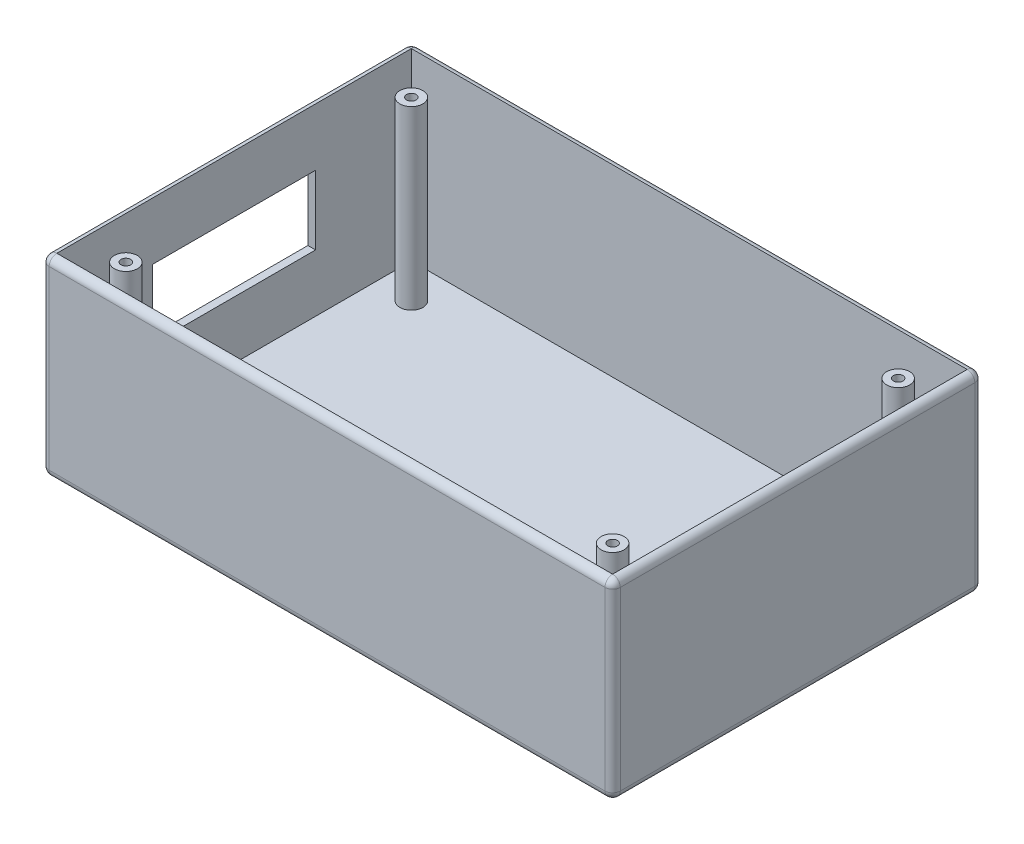
ISO-10303-21;
HEADER;
FILE_DESCRIPTION(('STEP AP214'),'2;1');
FILE_NAME('part.step','',(''),(''),'','','');
FILE_SCHEMA(('AUTOMOTIVE_DESIGN { 1 0 10303 214 1 1 1 1 }'));
ENDSEC;
DATA;
#1=APPLICATION_CONTEXT('core data for automotive mechanical design processes');
#2=APPLICATION_PROTOCOL_DEFINITION('international standard','automotive_design',2000,#1);
#3=PRODUCT_CONTEXT('',#1,'mechanical');
#4=PRODUCT('Part','Part','',(#3));
#5=PRODUCT_RELATED_PRODUCT_CATEGORY('part','',(#4));
#6=PRODUCT_DEFINITION_FORMATION('','',#4);
#7=PRODUCT_DEFINITION_CONTEXT('part definition',#1,'design');
#8=PRODUCT_DEFINITION('design','',#6,#7);
#9=PRODUCT_DEFINITION_SHAPE('','',#8);
#10=(LENGTH_UNIT() NAMED_UNIT(*) SI_UNIT(.MILLI.,.METRE.));
#11=(NAMED_UNIT(*) PLANE_ANGLE_UNIT() SI_UNIT($,.RADIAN.));
#12=(NAMED_UNIT(*) SI_UNIT($,.STERADIAN.) SOLID_ANGLE_UNIT());
#13=UNCERTAINTY_MEASURE_WITH_UNIT(LENGTH_MEASURE(1.E-05),#10,'distance_accuracy_value','');
#14=(GEOMETRIC_REPRESENTATION_CONTEXT(3) GLOBAL_UNCERTAINTY_ASSIGNED_CONTEXT((#13)) GLOBAL_UNIT_ASSIGNED_CONTEXT((#10,
#11,#12)) REPRESENTATION_CONTEXT('',''));
#15=CARTESIAN_POINT('',(0.,0.,0.));
#16=DIRECTION('',(0.,0.,1.));
#17=DIRECTION('',(1.,0.,0.));
#18=AXIS2_PLACEMENT_3D('',#15,#16,#17);
#19=CARTESIAN_POINT('',(74.5,50.,-48.25));
#20=DIRECTION('',(-1.,0.,0.));
#21=DIRECTION('',(0.,0.,1.));
#22=AXIS2_PLACEMENT_3D('',#19,#20,#21);
#23=PLANE('',#22);
#24=DIRECTION('',(0.,-1.,0.));
#25=VECTOR('',#24,1.);
#26=CARTESIAN_POINT('',(74.5,50.,-46.25));
#27=LINE('',#26,#25);
#28=CARTESIAN_POINT('',(74.5,2.,-46.25));
#29=VERTEX_POINT('',#28);
#30=CARTESIAN_POINT('',(74.5,48.,-46.25));
#31=VERTEX_POINT('',#30);
#32=EDGE_CURVE('E266',#29,#31,#27,.F.);
#33=ORIENTED_EDGE('',*,*,#32,.T.);
#34=DIRECTION('',(0.,0.,-1.));
#35=VECTOR('',#34,1.);
#36=CARTESIAN_POINT('',(74.5,48.,48.25));
#37=LINE('',#36,#35);
#38=CARTESIAN_POINT('',(74.5,48.,46.25));
#39=VERTEX_POINT('',#38);
#40=EDGE_CURVE('E268',#31,#39,#37,.F.);
#41=ORIENTED_EDGE('',*,*,#40,.T.);
#42=DIRECTION('',(0.,-1.,0.));
#43=VECTOR('',#42,1.);
#44=CARTESIAN_POINT('',(74.5,50.,46.25));
#45=LINE('',#44,#43);
#46=CARTESIAN_POINT('',(74.5,2.,46.25));
#47=VERTEX_POINT('',#46);
#48=EDGE_CURVE('E262',#39,#47,#45,.T.);
#49=ORIENTED_EDGE('',*,*,#48,.T.);
#50=DIRECTION('',(0.,0.,-1.));
#51=VECTOR('',#50,1.);
#52=CARTESIAN_POINT('',(74.5,2.,-48.25));
#53=LINE('',#52,#51);
#54=EDGE_CURVE('E264',#47,#29,#53,.T.);
#55=ORIENTED_EDGE('',*,*,#54,.T.);
#56=EDGE_LOOP('',(#33,#41,#49,#55));
#57=FACE_BOUND('',#56,.T.);
#58=ADVANCED_FACE('F34',(#57),#23,.F.);
#59=CARTESIAN_POINT('',(-74.5,50.,-48.25));
#60=DIRECTION('',(0.,0.,1.));
#61=DIRECTION('',(1.,0.,0.));
#62=AXIS2_PLACEMENT_3D('',#59,#60,#61);
#63=PLANE('',#62);
#64=DIRECTION('',(-1.,0.,0.));
#65=VECTOR('',#64,1.);
#66=CARTESIAN_POINT('',(74.5,48.,-48.25));
#67=LINE('',#66,#65);
#68=CARTESIAN_POINT('',(-72.5,48.,-48.25));
#69=VERTEX_POINT('',#68);
#70=CARTESIAN_POINT('',(72.5,48.,-48.25));
#71=VERTEX_POINT('',#70);
#72=EDGE_CURVE('E273',#69,#71,#67,.F.);
#73=ORIENTED_EDGE('',*,*,#72,.T.);
#74=DIRECTION('',(0.,-1.,0.));
#75=VECTOR('',#74,1.);
#76=CARTESIAN_POINT('',(72.5,50.,-48.25));
#77=LINE('',#76,#75);
#78=CARTESIAN_POINT('',(72.5,2.,-48.25));
#79=VERTEX_POINT('',#78);
#80=EDGE_CURVE('E277',#71,#79,#77,.T.);
#81=ORIENTED_EDGE('',*,*,#80,.T.);
#82=DIRECTION('',(-1.,0.,0.));
#83=VECTOR('',#82,1.);
#84=CARTESIAN_POINT('',(-74.5,2.,-48.25));
#85=LINE('',#84,#83);
#86=CARTESIAN_POINT('',(-72.5,2.,-48.25));
#87=VERTEX_POINT('',#86);
#88=EDGE_CURVE('E275',#79,#87,#85,.T.);
#89=ORIENTED_EDGE('',*,*,#88,.T.);
#90=DIRECTION('',(0.,-1.,0.));
#91=VECTOR('',#90,1.);
#92=CARTESIAN_POINT('',(-72.5,50.,-48.25));
#93=LINE('',#92,#91);
#94=EDGE_CURVE('E271',#87,#69,#93,.F.);
#95=ORIENTED_EDGE('',*,*,#94,.T.);
#96=EDGE_LOOP('',(#73,#81,#89,#95));
#97=FACE_BOUND('',#96,.T.);
#98=ADVANCED_FACE('F398',(#97),#63,.F.);
#99=CARTESIAN_POINT('',(-74.5,50.,-48.25));
#100=DIRECTION('',(1.,0.,0.));
#101=DIRECTION('',(0.,0.,-1.));
#102=AXIS2_PLACEMENT_3D('',#99,#100,#101);
#103=PLANE('',#102);
#104=DIRECTION('',(0.,0.,1.));
#105=VECTOR('',#104,1.);
#106=CARTESIAN_POINT('',(-74.5,2.,-48.25));
#107=LINE('',#106,#105);
#108=CARTESIAN_POINT('',(-74.5,2.,-46.25));
#109=VERTEX_POINT('',#108);
#110=CARTESIAN_POINT('',(-74.5,2.,46.25));
#111=VERTEX_POINT('',#110);
#112=EDGE_CURVE('E58',#109,#111,#107,.T.);
#113=ORIENTED_EDGE('',*,*,#112,.T.);
#114=DIRECTION('',(0.,-1.,0.));
#115=VECTOR('',#114,1.);
#116=CARTESIAN_POINT('',(-74.5,50.,46.25));
#117=LINE('',#116,#115);
#118=CARTESIAN_POINT('',(-74.5,48.,46.25));
#119=VERTEX_POINT('',#118);
#120=EDGE_CURVE('E11',#111,#119,#117,.F.);
#121=ORIENTED_EDGE('',*,*,#120,.T.);
#122=DIRECTION('',(0.,0.,1.));
#123=VECTOR('',#122,1.);
#124=CARTESIAN_POINT('',(-74.5,48.,-48.25));
#125=LINE('',#124,#123);
#126=CARTESIAN_POINT('',(-74.5,48.,-46.25));
#127=VERTEX_POINT('',#126);
#128=EDGE_CURVE('E43',#119,#127,#125,.F.);
#129=ORIENTED_EDGE('',*,*,#128,.T.);
#130=DIRECTION('',(0.,-1.,0.));
#131=VECTOR('',#130,1.);
#132=CARTESIAN_POINT('',(-74.5,50.,-46.25));
#133=LINE('',#132,#131);
#134=EDGE_CURVE('E298',#127,#109,#133,.T.);
#135=ORIENTED_EDGE('',*,*,#134,.T.);
#136=EDGE_LOOP('',(#113,#121,#129,#135));
#137=FACE_BOUND('',#136,.T.);
#138=DIRECTION('',(0.,0.,1.));
#139=VECTOR('',#138,1.);
#140=CARTESIAN_POINT('',(-74.5,35.,-48.25));
#141=LINE('',#140,#139);
#142=CARTESIAN_POINT('',(-74.5,35.,-21.25));
#143=VERTEX_POINT('',#142);
#144=CARTESIAN_POINT('',(-74.5,35.,21.25));
#145=VERTEX_POINT('',#144);
#146=EDGE_CURVE('E201',#143,#145,#141,.T.);
#147=ORIENTED_EDGE('',*,*,#146,.T.);
#148=DIRECTION('',(0.,-1.,0.));
#149=VECTOR('',#148,1.);
#150=CARTESIAN_POINT('',(-74.5,50.,21.25));
#151=LINE('',#150,#149);
#152=CARTESIAN_POINT('',(-74.5,17.,21.25));
#153=VERTEX_POINT('',#152);
#154=EDGE_CURVE('E204',#145,#153,#151,.T.);
#155=ORIENTED_EDGE('',*,*,#154,.T.);
#156=DIRECTION('',(0.,0.,-1.));
#157=VECTOR('',#156,1.);
#158=CARTESIAN_POINT('',(-74.5,17.,-48.25));
#159=LINE('',#158,#157);
#160=CARTESIAN_POINT('',(-74.5,17.,-21.25));
#161=VERTEX_POINT('',#160);
#162=EDGE_CURVE('E196',#153,#161,#159,.T.);
#163=ORIENTED_EDGE('',*,*,#162,.T.);
#164=DIRECTION('',(0.,1.,0.));
#165=VECTOR('',#164,1.);
#166=CARTESIAN_POINT('',(-74.5,50.,-21.25));
#167=LINE('',#166,#165);
#168=EDGE_CURVE('E171',#161,#143,#167,.T.);
#169=ORIENTED_EDGE('',*,*,#168,.T.);
#170=EDGE_LOOP('',(#147,#155,#163,#169));
#171=FACE_BOUND('',#170,.T.);
#172=ADVANCED_FACE('F395',(#137,#171),#103,.F.);
#173=CARTESIAN_POINT('',(-74.5,50.,48.25));
#174=DIRECTION('',(0.,0.,-1.));
#175=DIRECTION('',(-1.,0.,0.));
#176=AXIS2_PLACEMENT_3D('',#173,#174,#175);
#177=PLANE('',#176);
#178=DIRECTION('',(1.,0.,0.));
#179=VECTOR('',#178,1.);
#180=CARTESIAN_POINT('',(-74.5,48.,48.25));
#181=LINE('',#180,#179);
#182=CARTESIAN_POINT('',(72.5,48.,48.25));
#183=VERTEX_POINT('',#182);
#184=CARTESIAN_POINT('',(-72.5,48.,48.25));
#185=VERTEX_POINT('',#184);
#186=EDGE_CURVE('E293',#183,#185,#181,.F.);
#187=ORIENTED_EDGE('',*,*,#186,.T.);
#188=DIRECTION('',(0.,-1.,0.));
#189=VECTOR('',#188,1.);
#190=CARTESIAN_POINT('',(-72.5,50.,48.25));
#191=LINE('',#190,#189);
#192=CARTESIAN_POINT('',(-72.5,2.,48.25));
#193=VERTEX_POINT('',#192);
#194=EDGE_CURVE('E295',#185,#193,#191,.T.);
#195=ORIENTED_EDGE('',*,*,#194,.T.);
#196=DIRECTION('',(1.,0.,0.));
#197=VECTOR('',#196,1.);
#198=CARTESIAN_POINT('',(-74.5,2.,48.25));
#199=LINE('',#198,#197);
#200=CARTESIAN_POINT('',(72.5,2.,48.25));
#201=VERTEX_POINT('',#200);
#202=EDGE_CURVE('E289',#193,#201,#199,.T.);
#203=ORIENTED_EDGE('',*,*,#202,.T.);
#204=DIRECTION('',(0.,-1.,0.));
#205=VECTOR('',#204,1.);
#206=CARTESIAN_POINT('',(72.5,50.,48.25));
#207=LINE('',#206,#205);
#208=EDGE_CURVE('E291',#201,#183,#207,.F.);
#209=ORIENTED_EDGE('',*,*,#208,.T.);
#210=EDGE_LOOP('',(#187,#195,#203,#209));
#211=FACE_BOUND('',#210,.T.);
#212=ADVANCED_FACE('F397',(#211),#177,.F.);
#213=CARTESIAN_POINT('',(0.,0.,0.));
#214=DIRECTION('',(0.,1.,0.));
#215=DIRECTION('',(0.,0.,1.));
#216=AXIS2_PLACEMENT_3D('',#213,#214,#215);
#217=PLANE('',#216);
#218=DIRECTION('',(-1.,0.,0.));
#219=VECTOR('',#218,1.);
#220=CARTESIAN_POINT('',(0.,0.,-46.25));
#221=LINE('',#220,#219);
#222=CARTESIAN_POINT('',(-72.5,0.,-46.25));
#223=VERTEX_POINT('',#222);
#224=CARTESIAN_POINT('',(72.5,0.,-46.25));
#225=VERTEX_POINT('',#224);
#226=EDGE_CURVE('E282',#223,#225,#221,.F.);
#227=ORIENTED_EDGE('',*,*,#226,.T.);
#228=DIRECTION('',(0.,0.,-1.));
#229=VECTOR('',#228,1.);
#230=CARTESIAN_POINT('',(72.5,0.,0.));
#231=LINE('',#230,#229);
#232=CARTESIAN_POINT('',(72.5,0.,46.25));
#233=VERTEX_POINT('',#232);
#234=EDGE_CURVE('E286',#225,#233,#231,.F.);
#235=ORIENTED_EDGE('',*,*,#234,.T.);
#236=DIRECTION('',(1.,0.,0.));
#237=VECTOR('',#236,1.);
#238=CARTESIAN_POINT('',(0.,0.,46.25));
#239=LINE('',#238,#237);
#240=CARTESIAN_POINT('',(-72.5,0.,46.25));
#241=VERTEX_POINT('',#240);
#242=EDGE_CURVE('E284',#233,#241,#239,.F.);
#243=ORIENTED_EDGE('',*,*,#242,.T.);
#244=DIRECTION('',(0.,0.,1.));
#245=VECTOR('',#244,1.);
#246=CARTESIAN_POINT('',(-72.5,0.,0.));
#247=LINE('',#246,#245);
#248=EDGE_CURVE('E280',#241,#223,#247,.F.);
#249=ORIENTED_EDGE('',*,*,#248,.T.);
#250=EDGE_LOOP('',(#227,#235,#243,#249));
#251=FACE_BOUND('',#250,.T.);
#252=ADVANCED_FACE('F404',(#251),#217,.F.);
#253=CARTESIAN_POINT('',(72.5,50.,-48.25));
#254=DIRECTION('',(-1.,0.,0.));
#255=DIRECTION('',(0.,0.,1.));
#256=AXIS2_PLACEMENT_3D('',#253,#254,#255);
#257=PLANE('',#256);
#258=DIRECTION('',(0.,0.,-1.));
#259=VECTOR('',#258,1.);
#260=CARTESIAN_POINT('',(72.5,2.,-48.25));
#261=LINE('',#260,#259);
#262=CARTESIAN_POINT('',(72.5,2.,46.25));
#263=VERTEX_POINT('',#262);
#264=CARTESIAN_POINT('',(72.5,2.,-46.25));
#265=VERTEX_POINT('',#264);
#266=EDGE_CURVE('E223',#263,#265,#261,.T.);
#267=ORIENTED_EDGE('',*,*,#266,.F.);
#268=DIRECTION('',(0.,-1.,0.));
#269=VECTOR('',#268,1.);
#270=CARTESIAN_POINT('',(72.5,50.,46.25));
#271=LINE('',#270,#269);
#272=CARTESIAN_POINT('',(72.5,50.,46.25));
#273=VERTEX_POINT('',#272);
#274=EDGE_CURVE('E234',#273,#263,#271,.T.);
#275=ORIENTED_EDGE('',*,*,#274,.F.);
#276=DIRECTION('',(0.,0.,-1.));
#277=VECTOR('',#276,1.);
#278=CARTESIAN_POINT('',(72.5,50.,-48.25));
#279=LINE('',#278,#277);
#280=CARTESIAN_POINT('',(72.5,50.,-46.25));
#281=VERTEX_POINT('',#280);
#282=EDGE_CURVE('E248',#273,#281,#279,.T.);
#283=ORIENTED_EDGE('',*,*,#282,.T.);
#284=DIRECTION('',(0.,-1.,0.));
#285=VECTOR('',#284,1.);
#286=CARTESIAN_POINT('',(72.5,50.,-46.25));
#287=LINE('',#286,#285);
#288=EDGE_CURVE('E229',#281,#265,#287,.T.);
#289=ORIENTED_EDGE('',*,*,#288,.T.);
#290=EDGE_LOOP('',(#267,#275,#283,#289));
#291=FACE_BOUND('',#290,.T.);
#292=ADVANCED_FACE('F532',(#291),#257,.T.);
#293=CARTESIAN_POINT('',(-74.5,50.,-46.25));
#294=DIRECTION('',(0.,0.,1.));
#295=DIRECTION('',(1.,0.,0.));
#296=AXIS2_PLACEMENT_3D('',#293,#294,#295);
#297=PLANE('',#296);
#298=DIRECTION('',(-1.,0.,0.));
#299=VECTOR('',#298,1.);
#300=CARTESIAN_POINT('',(-74.5,2.,-46.25));
#301=LINE('',#300,#299);
#302=CARTESIAN_POINT('',(-72.5,2.,-46.25));
#303=VERTEX_POINT('',#302);
#304=EDGE_CURVE('E228',#265,#303,#301,.T.);
#305=ORIENTED_EDGE('',*,*,#304,.F.);
#306=ORIENTED_EDGE('',*,*,#288,.F.);
#307=DIRECTION('',(-1.,0.,0.));
#308=VECTOR('',#307,1.);
#309=CARTESIAN_POINT('',(-74.5,50.,-46.25));
#310=LINE('',#309,#308);
#311=CARTESIAN_POINT('',(-72.5,50.,-46.25));
#312=VERTEX_POINT('',#311);
#313=EDGE_CURVE('E251',#281,#312,#310,.T.);
#314=ORIENTED_EDGE('',*,*,#313,.T.);
#315=DIRECTION('',(0.,-1.,0.));
#316=VECTOR('',#315,1.);
#317=CARTESIAN_POINT('',(-72.5,50.,-46.25));
#318=LINE('',#317,#316);
#319=EDGE_CURVE('E233',#312,#303,#318,.T.);
#320=ORIENTED_EDGE('',*,*,#319,.T.);
#321=EDGE_LOOP('',(#305,#306,#314,#320));
#322=FACE_BOUND('',#321,.T.);
#323=ADVANCED_FACE('F540',(#322),#297,.T.);
#324=CARTESIAN_POINT('',(-72.5,50.,-48.25));
#325=DIRECTION('',(1.,0.,0.));
#326=DIRECTION('',(0.,0.,-1.));
#327=AXIS2_PLACEMENT_3D('',#324,#325,#326);
#328=PLANE('',#327);
#329=DIRECTION('',(0.,-1.,0.));
#330=VECTOR('',#329,1.);
#331=CARTESIAN_POINT('',(-72.5,35.,21.25));
#332=LINE('',#331,#330);
#333=CARTESIAN_POINT('',(-72.5,35.,21.25));
#334=VERTEX_POINT('',#333);
#335=CARTESIAN_POINT('',(-72.5,17.,21.25));
#336=VERTEX_POINT('',#335);
#337=EDGE_CURVE('E184',#334,#336,#332,.T.);
#338=ORIENTED_EDGE('',*,*,#337,.F.);
#339=DIRECTION('',(0.,0.,1.));
#340=VECTOR('',#339,1.);
#341=CARTESIAN_POINT('',(-72.5,35.,21.25));
#342=LINE('',#341,#340);
#343=CARTESIAN_POINT('',(-72.5,35.,-21.25));
#344=VERTEX_POINT('',#343);
#345=EDGE_CURVE('E189',#344,#334,#342,.T.);
#346=ORIENTED_EDGE('',*,*,#345,.F.);
#347=DIRECTION('',(0.,1.,0.));
#348=VECTOR('',#347,1.);
#349=CARTESIAN_POINT('',(-72.5,35.,-21.25));
#350=LINE('',#349,#348);
#351=CARTESIAN_POINT('',(-72.5,17.,-21.25));
#352=VERTEX_POINT('',#351);
#353=EDGE_CURVE('E168',#352,#344,#350,.T.);
#354=ORIENTED_EDGE('',*,*,#353,.F.);
#355=DIRECTION('',(0.,0.,-1.));
#356=VECTOR('',#355,1.);
#357=CARTESIAN_POINT('',(-72.5,17.,21.25));
#358=LINE('',#357,#356);
#359=EDGE_CURVE('E179',#336,#352,#358,.T.);
#360=ORIENTED_EDGE('',*,*,#359,.F.);
#361=EDGE_LOOP('',(#338,#346,#354,#360));
#362=FACE_BOUND('',#361,.T.);
#363=DIRECTION('',(0.,0.,1.));
#364=VECTOR('',#363,1.);
#365=CARTESIAN_POINT('',(-72.5,2.,-48.25));
#366=LINE('',#365,#364);
#367=CARTESIAN_POINT('',(-72.5,2.,46.25));
#368=VERTEX_POINT('',#367);
#369=EDGE_CURVE('E240',#303,#368,#366,.T.);
#370=ORIENTED_EDGE('',*,*,#369,.F.);
#371=ORIENTED_EDGE('',*,*,#319,.F.);
#372=DIRECTION('',(0.,0.,1.));
#373=VECTOR('',#372,1.);
#374=CARTESIAN_POINT('',(-72.5,50.,-48.25));
#375=LINE('',#374,#373);
#376=CARTESIAN_POINT('',(-72.5,50.,46.25));
#377=VERTEX_POINT('',#376);
#378=EDGE_CURVE('E253',#312,#377,#375,.T.);
#379=ORIENTED_EDGE('',*,*,#378,.T.);
#380=DIRECTION('',(0.,-1.,0.));
#381=VECTOR('',#380,1.);
#382=CARTESIAN_POINT('',(-72.5,50.,46.25));
#383=LINE('',#382,#381);
#384=EDGE_CURVE('E237',#377,#368,#383,.T.);
#385=ORIENTED_EDGE('',*,*,#384,.T.);
#386=EDGE_LOOP('',(#370,#371,#379,#385));
#387=FACE_BOUND('',#386,.T.);
#388=ADVANCED_FACE('F186',(#362,#387),#328,.T.);
#389=CARTESIAN_POINT('',(-74.5,50.,46.25));
#390=DIRECTION('',(0.,0.,-1.));
#391=DIRECTION('',(-1.,0.,0.));
#392=AXIS2_PLACEMENT_3D('',#389,#390,#391);
#393=PLANE('',#392);
#394=DIRECTION('',(1.,0.,0.));
#395=VECTOR('',#394,1.);
#396=CARTESIAN_POINT('',(-74.5,2.,46.25));
#397=LINE('',#396,#395);
#398=EDGE_CURVE('E244',#368,#263,#397,.T.);
#399=ORIENTED_EDGE('',*,*,#398,.F.);
#400=ORIENTED_EDGE('',*,*,#384,.F.);
#401=DIRECTION('',(1.,0.,0.));
#402=VECTOR('',#401,1.);
#403=CARTESIAN_POINT('',(-74.5,50.,46.25));
#404=LINE('',#403,#402);
#405=EDGE_CURVE('E238',#377,#273,#404,.T.);
#406=ORIENTED_EDGE('',*,*,#405,.T.);
#407=ORIENTED_EDGE('',*,*,#274,.T.);
#408=EDGE_LOOP('',(#399,#400,#406,#407));
#409=FACE_BOUND('',#408,.T.);
#410=ADVANCED_FACE('F529',(#409),#393,.T.);
#411=CARTESIAN_POINT('',(0.,2.,0.));
#412=DIRECTION('',(0.,1.,0.));
#413=DIRECTION('',(0.,0.,1.));
#414=AXIS2_PLACEMENT_3D('',#411,#412,#413);
#415=PLANE('',#414);
#416=CARTESIAN_POINT('',(-63.5,2.,37.25));
#417=DIRECTION('',(0.,1.,0.));
#418=DIRECTION('',(0.,0.,1.));
#419=AXIS2_PLACEMENT_3D('',#416,#417,#418);
#420=CIRCLE('',#419,3.00000000000001);
#421=CARTESIAN_POINT('',(-63.5,2.,40.25));
#422=VERTEX_POINT('',#421);
#423=EDGE_CURVE('E259',#422,#422,#420,.T.);
#424=ORIENTED_EDGE('',*,*,#423,.F.);
#425=EDGE_LOOP('',(#424));
#426=FACE_BOUND('',#425,.T.);
#427=CARTESIAN_POINT('',(63.5,2.,37.25));
#428=DIRECTION('',(0.,1.,0.));
#429=DIRECTION('',(0.,0.,1.));
#430=AXIS2_PLACEMENT_3D('',#427,#428,#429);
#431=CIRCLE('',#430,3.00000000000001);
#432=CARTESIAN_POINT('',(63.5,2.,40.25));
#433=VERTEX_POINT('',#432);
#434=EDGE_CURVE('E210',#433,#433,#431,.T.);
#435=ORIENTED_EDGE('',*,*,#434,.F.);
#436=EDGE_LOOP('',(#435));
#437=FACE_BOUND('',#436,.T.);
#438=CARTESIAN_POINT('',(63.5,2.,-37.25));
#439=DIRECTION('',(0.,1.,0.));
#440=DIRECTION('',(0.,0.,1.));
#441=AXIS2_PLACEMENT_3D('',#438,#439,#440);
#442=CIRCLE('',#441,3.00000000000001);
#443=CARTESIAN_POINT('',(63.5,2.,-34.25));
#444=VERTEX_POINT('',#443);
#445=EDGE_CURVE('E232',#444,#444,#442,.T.);
#446=ORIENTED_EDGE('',*,*,#445,.F.);
#447=EDGE_LOOP('',(#446));
#448=FACE_BOUND('',#447,.T.);
#449=CARTESIAN_POINT('',(-63.5,2.,-37.25));
#450=DIRECTION('',(0.,1.,0.));
#451=DIRECTION('',(0.,0.,1.));
#452=AXIS2_PLACEMENT_3D('',#449,#450,#451);
#453=CIRCLE('',#452,3.00000000000001);
#454=CARTESIAN_POINT('',(-63.5,2.,-34.25));
#455=VERTEX_POINT('',#454);
#456=EDGE_CURVE('E219',#455,#455,#453,.T.);
#457=ORIENTED_EDGE('',*,*,#456,.F.);
#458=EDGE_LOOP('',(#457));
#459=FACE_BOUND('',#458,.T.);
#460=ORIENTED_EDGE('',*,*,#266,.T.);
#461=ORIENTED_EDGE('',*,*,#304,.T.);
#462=ORIENTED_EDGE('',*,*,#369,.T.);
#463=ORIENTED_EDGE('',*,*,#398,.T.);
#464=EDGE_LOOP('',(#460,#461,#462,#463));
#465=FACE_BOUND('',#464,.T.);
#466=ADVANCED_FACE('F536',(#426,#437,#448,#459,#465),#415,.T.);
#467=CARTESIAN_POINT('',(-63.5,48.,-37.25));
#468=DIRECTION('',(0.,-1.,0.));
#469=DIRECTION('',(0.,0.,-1.));
#470=AXIS2_PLACEMENT_3D('',#467,#468,#469);
#471=CYLINDRICAL_SURFACE('',#470,3.00000000000001);
#472=CARTESIAN_POINT('',(-63.5,48.,-37.25));
#473=DIRECTION('',(0.,1.,0.));
#474=DIRECTION('',(0.,0.,1.));
#475=AXIS2_PLACEMENT_3D('',#472,#473,#474);
#476=CIRCLE('',#475,3.00000000000001);
#477=CARTESIAN_POINT('',(-63.5,48.,-34.25));
#478=VERTEX_POINT('',#477);
#479=EDGE_CURVE('E220',#478,#478,#476,.T.);
#480=ORIENTED_EDGE('',*,*,#479,.F.);
#481=EDGE_LOOP('',(#480));
#482=FACE_BOUND('',#481,.T.);
#483=ORIENTED_EDGE('',*,*,#456,.T.);
#484=EDGE_LOOP('',(#483));
#485=FACE_BOUND('',#484,.T.);
#486=ADVANCED_FACE('F555',(#482,#485),#471,.T.);
#487=CARTESIAN_POINT('',(0.,48.,0.));
#488=DIRECTION('',(0.,1.,0.));
#489=DIRECTION('',(0.,0.,1.));
#490=AXIS2_PLACEMENT_3D('',#487,#488,#489);
#491=PLANE('',#490);
#492=CARTESIAN_POINT('',(-63.5,48.,-37.25));
#493=DIRECTION('',(0.,1.,0.));
#494=DIRECTION('',(0.,0.,1.));
#495=AXIS2_PLACEMENT_3D('',#492,#493,#494);
#496=CIRCLE('',#495,1.25);
#497=CARTESIAN_POINT('',(-63.5,48.,-36.));
#498=VERTEX_POINT('',#497);
#499=EDGE_CURVE('E387',#498,#498,#496,.T.);
#500=ORIENTED_EDGE('',*,*,#499,.F.);
#501=EDGE_LOOP('',(#500));
#502=FACE_BOUND('',#501,.T.);
#503=ORIENTED_EDGE('',*,*,#479,.T.);
#504=EDGE_LOOP('',(#503));
#505=FACE_BOUND('',#504,.T.);
#506=ADVANCED_FACE('F837',(#502,#505),#491,.T.);
#507=CARTESIAN_POINT('',(63.5,48.,-37.25));
#508=DIRECTION('',(0.,-1.,0.));
#509=DIRECTION('',(0.,0.,-1.));
#510=AXIS2_PLACEMENT_3D('',#507,#508,#509);
#511=CYLINDRICAL_SURFACE('',#510,3.00000000000001);
#512=CARTESIAN_POINT('',(63.5,48.,-37.25));
#513=DIRECTION('',(0.,1.,0.));
#514=DIRECTION('',(0.,0.,1.));
#515=AXIS2_PLACEMENT_3D('',#512,#513,#514);
#516=CIRCLE('',#515,3.00000000000001);
#517=CARTESIAN_POINT('',(63.5,48.,-34.25));
#518=VERTEX_POINT('',#517);
#519=EDGE_CURVE('E214',#518,#518,#516,.F.);
#520=ORIENTED_EDGE('',*,*,#519,.T.);
#521=EDGE_LOOP('',(#520));
#522=FACE_BOUND('',#521,.T.);
#523=ORIENTED_EDGE('',*,*,#445,.T.);
#524=EDGE_LOOP('',(#523));
#525=FACE_BOUND('',#524,.T.);
#526=ADVANCED_FACE('F830',(#522,#525),#511,.T.);
#527=CARTESIAN_POINT('',(0.,48.,0.));
#528=DIRECTION('',(0.,1.,0.));
#529=DIRECTION('',(0.,0.,1.));
#530=AXIS2_PLACEMENT_3D('',#527,#528,#529);
#531=PLANE('',#530);
#532=CARTESIAN_POINT('',(63.5,48.,-37.25));
#533=DIRECTION('',(0.,-1.,0.));
#534=DIRECTION('',(0.,0.,-1.));
#535=AXIS2_PLACEMENT_3D('',#532,#533,#534);
#536=CIRCLE('',#535,1.25);
#537=CARTESIAN_POINT('',(63.5,48.,-38.5));
#538=VERTEX_POINT('',#537);
#539=EDGE_CURVE('E372',#538,#538,#536,.T.);
#540=ORIENTED_EDGE('',*,*,#539,.T.);
#541=EDGE_LOOP('',(#540));
#542=FACE_BOUND('',#541,.T.);
#543=ORIENTED_EDGE('',*,*,#519,.F.);
#544=EDGE_LOOP('',(#543));
#545=FACE_BOUND('',#544,.T.);
#546=ADVANCED_FACE('F822',(#542,#545),#531,.T.);
#547=CARTESIAN_POINT('',(63.5,48.,37.25));
#548=DIRECTION('',(0.,-1.,0.));
#549=DIRECTION('',(0.,0.,-1.));
#550=AXIS2_PLACEMENT_3D('',#547,#548,#549);
#551=CYLINDRICAL_SURFACE('',#550,3.00000000000001);
#552=CARTESIAN_POINT('',(63.5,48.,37.25));
#553=DIRECTION('',(0.,1.,0.));
#554=DIRECTION('',(0.,0.,1.));
#555=AXIS2_PLACEMENT_3D('',#552,#553,#554);
#556=CIRCLE('',#555,3.00000000000001);
#557=CARTESIAN_POINT('',(63.5,48.,40.25));
#558=VERTEX_POINT('',#557);
#559=EDGE_CURVE('E211',#558,#558,#556,.T.);
#560=ORIENTED_EDGE('',*,*,#559,.F.);
#561=EDGE_LOOP('',(#560));
#562=FACE_BOUND('',#561,.T.);
#563=ORIENTED_EDGE('',*,*,#434,.T.);
#564=EDGE_LOOP('',(#563));
#565=FACE_BOUND('',#564,.T.);
#566=ADVANCED_FACE('F814',(#562,#565),#551,.T.);
#567=CARTESIAN_POINT('',(0.,48.,0.));
#568=DIRECTION('',(0.,1.,0.));
#569=DIRECTION('',(0.,0.,1.));
#570=AXIS2_PLACEMENT_3D('',#567,#568,#569);
#571=PLANE('',#570);
#572=CARTESIAN_POINT('',(63.5,48.,37.25));
#573=DIRECTION('',(0.,1.,0.));
#574=DIRECTION('',(0.,0.,1.));
#575=AXIS2_PLACEMENT_3D('',#572,#573,#574);
#576=CIRCLE('',#575,1.25);
#577=CARTESIAN_POINT('',(63.5,48.,38.5));
#578=VERTEX_POINT('',#577);
#579=EDGE_CURVE('E383',#578,#578,#576,.T.);
#580=ORIENTED_EDGE('',*,*,#579,.F.);
#581=EDGE_LOOP('',(#580));
#582=FACE_BOUND('',#581,.T.);
#583=ORIENTED_EDGE('',*,*,#559,.T.);
#584=EDGE_LOOP('',(#583));
#585=FACE_BOUND('',#584,.T.);
#586=ADVANCED_FACE('F806',(#582,#585),#571,.T.);
#587=CARTESIAN_POINT('',(-63.5,48.,37.25));
#588=DIRECTION('',(0.,-1.,0.));
#589=DIRECTION('',(0.,0.,-1.));
#590=AXIS2_PLACEMENT_3D('',#587,#588,#589);
#591=CYLINDRICAL_SURFACE('',#590,3.00000000000001);
#592=CARTESIAN_POINT('',(-63.5,48.,37.25));
#593=DIRECTION('',(0.,1.,0.));
#594=DIRECTION('',(0.,0.,1.));
#595=AXIS2_PLACEMENT_3D('',#592,#593,#594);
#596=CIRCLE('',#595,3.00000000000001);
#597=CARTESIAN_POINT('',(-63.5,48.,40.25));
#598=VERTEX_POINT('',#597);
#599=EDGE_CURVE('E207',#598,#598,#596,.F.);
#600=ORIENTED_EDGE('',*,*,#599,.T.);
#601=EDGE_LOOP('',(#600));
#602=FACE_BOUND('',#601,.T.);
#603=ORIENTED_EDGE('',*,*,#423,.T.);
#604=EDGE_LOOP('',(#603));
#605=FACE_BOUND('',#604,.T.);
#606=ADVANCED_FACE('F798',(#602,#605),#591,.T.);
#607=CARTESIAN_POINT('',(0.,48.,0.));
#608=DIRECTION('',(0.,1.,0.));
#609=DIRECTION('',(0.,0.,1.));
#610=AXIS2_PLACEMENT_3D('',#607,#608,#609);
#611=PLANE('',#610);
#612=CARTESIAN_POINT('',(-63.5,48.,37.25));
#613=DIRECTION('',(0.,-1.,0.));
#614=DIRECTION('',(0.,0.,-1.));
#615=AXIS2_PLACEMENT_3D('',#612,#613,#614);
#616=CIRCLE('',#615,1.25);
#617=CARTESIAN_POINT('',(-63.5,48.,36.));
#618=VERTEX_POINT('',#617);
#619=EDGE_CURVE('E380',#618,#618,#616,.T.);
#620=ORIENTED_EDGE('',*,*,#619,.T.);
#621=EDGE_LOOP('',(#620));
#622=FACE_BOUND('',#621,.T.);
#623=ORIENTED_EDGE('',*,*,#599,.F.);
#624=EDGE_LOOP('',(#623));
#625=FACE_BOUND('',#624,.T.);
#626=ADVANCED_FACE('F791',(#622,#625),#611,.T.);
#627=CARTESIAN_POINT('',(-118.5,35.,21.25));
#628=DIRECTION('',(0.,0.,1.));
#629=DIRECTION('',(0.,-1.,0.));
#630=AXIS2_PLACEMENT_3D('',#627,#628,#629);
#631=PLANE('',#630);
#632=DIRECTION('',(1.,0.,0.));
#633=VECTOR('',#632,1.);
#634=CARTESIAN_POINT('',(-118.5,35.,21.25));
#635=LINE('',#634,#633);
#636=EDGE_CURVE('E194',#145,#334,#635,.T.);
#637=ORIENTED_EDGE('',*,*,#636,.T.);
#638=ORIENTED_EDGE('',*,*,#337,.T.);
#639=DIRECTION('',(1.,0.,0.));
#640=VECTOR('',#639,1.);
#641=CARTESIAN_POINT('',(-118.5,17.,21.25));
#642=LINE('',#641,#640);
#643=EDGE_CURVE('E175',#153,#336,#642,.T.);
#644=ORIENTED_EDGE('',*,*,#643,.F.);
#645=ORIENTED_EDGE('',*,*,#154,.F.);
#646=EDGE_LOOP('',(#637,#638,#644,#645));
#647=FACE_BOUND('',#646,.T.);
#648=ADVANCED_FACE('F390',(#647),#631,.F.);
#649=CARTESIAN_POINT('',(-118.5,35.,21.25));
#650=DIRECTION('',(0.,1.,0.));
#651=DIRECTION('',(0.,0.,1.));
#652=AXIS2_PLACEMENT_3D('',#649,#650,#651);
#653=PLANE('',#652);
#654=DIRECTION('',(1.,0.,0.));
#655=VECTOR('',#654,1.);
#656=CARTESIAN_POINT('',(-118.5,35.,-21.25));
#657=LINE('',#656,#655);
#658=EDGE_CURVE('E174',#143,#344,#657,.T.);
#659=ORIENTED_EDGE('',*,*,#658,.T.);
#660=ORIENTED_EDGE('',*,*,#345,.T.);
#661=ORIENTED_EDGE('',*,*,#636,.F.);
#662=ORIENTED_EDGE('',*,*,#146,.F.);
#663=EDGE_LOOP('',(#659,#660,#661,#662));
#664=FACE_BOUND('',#663,.T.);
#665=ADVANCED_FACE('F393',(#664),#653,.F.);
#666=CARTESIAN_POINT('',(-118.5,35.,-21.25));
#667=DIRECTION('',(0.,0.,-1.));
#668=DIRECTION('',(-1.,0.,0.));
#669=AXIS2_PLACEMENT_3D('',#666,#667,#668);
#670=PLANE('',#669);
#671=DIRECTION('',(1.,0.,0.));
#672=VECTOR('',#671,1.);
#673=CARTESIAN_POINT('',(-118.5,17.,-21.25));
#674=LINE('',#673,#672);
#675=EDGE_CURVE('E163',#161,#352,#674,.T.);
#676=ORIENTED_EDGE('',*,*,#675,.T.);
#677=ORIENTED_EDGE('',*,*,#353,.T.);
#678=ORIENTED_EDGE('',*,*,#658,.F.);
#679=ORIENTED_EDGE('',*,*,#168,.F.);
#680=EDGE_LOOP('',(#676,#677,#678,#679));
#681=FACE_BOUND('',#680,.T.);
#682=ADVANCED_FACE('F165',(#681),#670,.F.);
#683=CARTESIAN_POINT('',(-118.5,17.,21.25));
#684=DIRECTION('',(0.,-1.,0.));
#685=DIRECTION('',(0.,0.,-1.));
#686=AXIS2_PLACEMENT_3D('',#683,#684,#685);
#687=PLANE('',#686);
#688=ORIENTED_EDGE('',*,*,#643,.T.);
#689=ORIENTED_EDGE('',*,*,#359,.T.);
#690=ORIENTED_EDGE('',*,*,#675,.F.);
#691=ORIENTED_EDGE('',*,*,#162,.F.);
#692=EDGE_LOOP('',(#688,#689,#690,#691));
#693=FACE_BOUND('',#692,.T.);
#694=ADVANCED_FACE('F180',(#693),#687,.F.);
#695=CARTESIAN_POINT('',(-63.5,-1.53553390593274,37.25));
#696=DIRECTION('',(0.,1.,0.));
#697=DIRECTION('',(0.,0.,1.));
#698=AXIS2_PLACEMENT_3D('',#695,#696,#697);
#699=CYLINDRICAL_SURFACE('',#698,1.25);
#700=CARTESIAN_POINT('',(-63.5,2.,37.25));
#701=DIRECTION('',(0.,1.,0.));
#702=DIRECTION('',(0.,0.,1.));
#703=AXIS2_PLACEMENT_3D('',#700,#701,#702);
#704=CIRCLE('',#703,1.25);
#705=CARTESIAN_POINT('',(-63.5,2.,38.5));
#706=VERTEX_POINT('',#705);
#707=EDGE_CURVE('E377',#706,#706,#704,.T.);
#708=ORIENTED_EDGE('',*,*,#707,.F.);
#709=EDGE_LOOP('',(#708));
#710=FACE_BOUND('',#709,.T.);
#711=ORIENTED_EDGE('',*,*,#619,.F.);
#712=EDGE_LOOP('',(#711));
#713=FACE_BOUND('',#712,.T.);
#714=ADVANCED_FACE('F756',(#710,#713),#699,.F.);
#715=CARTESIAN_POINT('',(0.,2.,0.));
#716=DIRECTION('',(0.,1.,0.));
#717=DIRECTION('',(0.,0.,1.));
#718=AXIS2_PLACEMENT_3D('',#715,#716,#717);
#719=PLANE('',#718);
#720=ORIENTED_EDGE('',*,*,#707,.T.);
#721=EDGE_LOOP('',(#720));
#722=FACE_BOUND('',#721,.T.);
#723=ADVANCED_FACE('F748',(#722),#719,.T.);
#724=CARTESIAN_POINT('',(63.5,-1.53553390593274,37.25));
#725=DIRECTION('',(0.,1.,0.));
#726=DIRECTION('',(0.,0.,1.));
#727=AXIS2_PLACEMENT_3D('',#724,#725,#726);
#728=CYLINDRICAL_SURFACE('',#727,1.25);
#729=CARTESIAN_POINT('',(63.5,2.,37.25));
#730=DIRECTION('',(0.,1.,0.));
#731=DIRECTION('',(0.,0.,1.));
#732=AXIS2_PLACEMENT_3D('',#729,#730,#731);
#733=CIRCLE('',#732,1.25);
#734=CARTESIAN_POINT('',(63.5,2.,38.5));
#735=VERTEX_POINT('',#734);
#736=EDGE_CURVE('E386',#735,#735,#733,.F.);
#737=ORIENTED_EDGE('',*,*,#736,.T.);
#738=EDGE_LOOP('',(#737));
#739=FACE_BOUND('',#738,.T.);
#740=ORIENTED_EDGE('',*,*,#579,.T.);
#741=EDGE_LOOP('',(#740));
#742=FACE_BOUND('',#741,.T.);
#743=ADVANCED_FACE('F740',(#739,#742),#728,.F.);
#744=CARTESIAN_POINT('',(0.,2.,0.));
#745=DIRECTION('',(0.,1.,0.));
#746=DIRECTION('',(0.,0.,1.));
#747=AXIS2_PLACEMENT_3D('',#744,#745,#746);
#748=PLANE('',#747);
#749=ORIENTED_EDGE('',*,*,#736,.F.);
#750=EDGE_LOOP('',(#749));
#751=FACE_BOUND('',#750,.T.);
#752=ADVANCED_FACE('F732',(#751),#748,.T.);
#753=CARTESIAN_POINT('',(63.5,-1.53553390593274,-37.25));
#754=DIRECTION('',(0.,1.,0.));
#755=DIRECTION('',(0.,0.,1.));
#756=AXIS2_PLACEMENT_3D('',#753,#754,#755);
#757=CYLINDRICAL_SURFACE('',#756,1.25);
#758=CARTESIAN_POINT('',(63.5,2.,-37.25));
#759=DIRECTION('',(0.,1.,0.));
#760=DIRECTION('',(0.,0.,1.));
#761=AXIS2_PLACEMENT_3D('',#758,#759,#760);
#762=CIRCLE('',#761,1.25);
#763=CARTESIAN_POINT('',(63.5,2.,-36.));
#764=VERTEX_POINT('',#763);
#765=EDGE_CURVE('E367',#764,#764,#762,.T.);
#766=ORIENTED_EDGE('',*,*,#765,.F.);
#767=EDGE_LOOP('',(#766));
#768=FACE_BOUND('',#767,.T.);
#769=ORIENTED_EDGE('',*,*,#539,.F.);
#770=EDGE_LOOP('',(#769));
#771=FACE_BOUND('',#770,.T.);
#772=ADVANCED_FACE('F725',(#768,#771),#757,.F.);
#773=CARTESIAN_POINT('',(0.,2.,0.));
#774=DIRECTION('',(0.,1.,0.));
#775=DIRECTION('',(0.,0.,1.));
#776=AXIS2_PLACEMENT_3D('',#773,#774,#775);
#777=PLANE('',#776);
#778=ORIENTED_EDGE('',*,*,#765,.T.);
#779=EDGE_LOOP('',(#778));
#780=FACE_BOUND('',#779,.T.);
#781=ADVANCED_FACE('F717',(#780),#777,.T.);
#782=CARTESIAN_POINT('',(-63.5,-1.53553390593274,-37.25));
#783=DIRECTION('',(0.,1.,0.));
#784=DIRECTION('',(0.,0.,1.));
#785=AXIS2_PLACEMENT_3D('',#782,#783,#784);
#786=CYLINDRICAL_SURFACE('',#785,1.25);
#787=CARTESIAN_POINT('',(-63.5,2.,-37.25));
#788=DIRECTION('',(0.,1.,0.));
#789=DIRECTION('',(0.,0.,1.));
#790=AXIS2_PLACEMENT_3D('',#787,#788,#789);
#791=CIRCLE('',#790,1.25);
#792=CARTESIAN_POINT('',(-63.5,2.,-36.));
#793=VERTEX_POINT('',#792);
#794=EDGE_CURVE('E906',#793,#793,#791,.F.);
#795=ORIENTED_EDGE('',*,*,#794,.T.);
#796=EDGE_LOOP('',(#795));
#797=FACE_BOUND('',#796,.T.);
#798=ORIENTED_EDGE('',*,*,#499,.T.);
#799=EDGE_LOOP('',(#798));
#800=FACE_BOUND('',#799,.T.);
#801=ADVANCED_FACE('F710',(#797,#800),#786,.F.);
#802=CARTESIAN_POINT('',(0.,2.,0.));
#803=DIRECTION('',(0.,1.,0.));
#804=DIRECTION('',(0.,0.,1.));
#805=AXIS2_PLACEMENT_3D('',#802,#803,#804);
#806=PLANE('',#805);
#807=ORIENTED_EDGE('',*,*,#794,.F.);
#808=EDGE_LOOP('',(#807));
#809=FACE_BOUND('',#808,.T.);
#810=ADVANCED_FACE('F489',(#809),#806,.T.);
#811=CARTESIAN_POINT('',(-72.5,2.,-48.25));
#812=DIRECTION('',(0.,0.,1.));
#813=DIRECTION('',(1.,0.,0.));
#814=AXIS2_PLACEMENT_3D('',#811,#812,#813);
#815=CYLINDRICAL_SURFACE('',#814,2.);
#816=CARTESIAN_POINT('',(-72.5,2.,46.25));
#817=DIRECTION('',(0.,0.,1.));
#818=DIRECTION('',(1.,0.,0.));
#819=AXIS2_PLACEMENT_3D('',#816,#817,#818);
#820=CIRCLE('',#819,2.);
#821=EDGE_CURVE('E38',#111,#241,#820,.T.);
#822=ORIENTED_EDGE('',*,*,#821,.F.);
#823=ORIENTED_EDGE('',*,*,#112,.F.);
#824=CARTESIAN_POINT('',(-72.5,2.,-46.25));
#825=DIRECTION('',(0.,0.,-1.));
#826=DIRECTION('',(-1.,0.,0.));
#827=AXIS2_PLACEMENT_3D('',#824,#825,#826);
#828=CIRCLE('',#827,2.);
#829=EDGE_CURVE('E360',#223,#109,#828,.T.);
#830=ORIENTED_EDGE('',*,*,#829,.F.);
#831=ORIENTED_EDGE('',*,*,#248,.F.);
#832=EDGE_LOOP('',(#822,#823,#830,#831));
#833=FACE_BOUND('',#832,.T.);
#834=ADVANCED_FACE('F36',(#833),#815,.T.);
#835=CARTESIAN_POINT('',(-72.5,2.,46.25));
#836=DIRECTION('',(0.,-1.,0.));
#837=DIRECTION('',(0.,0.,-1.));
#838=AXIS2_PLACEMENT_3D('',#835,#836,#837);
#839=SPHERICAL_SURFACE('',#838,2.);
#840=CARTESIAN_POINT('',(-72.5,2.,46.25));
#841=DIRECTION('',(0.,-1.,0.));
#842=DIRECTION('',(0.,0.,-1.));
#843=AXIS2_PLACEMENT_3D('',#840,#841,#842);
#844=CIRCLE('',#843,2.);
#845=EDGE_CURVE('E355',#111,#193,#844,.F.);
#846=ORIENTED_EDGE('',*,*,#845,.F.);
#847=ORIENTED_EDGE('',*,*,#821,.T.);
#848=CARTESIAN_POINT('',(-72.5,2.,46.25));
#849=DIRECTION('',(-1.,0.,0.));
#850=DIRECTION('',(0.,0.,1.));
#851=AXIS2_PLACEMENT_3D('',#848,#849,#850);
#852=CIRCLE('',#851,2.);
#853=EDGE_CURVE('E358',#193,#241,#852,.F.);
#854=ORIENTED_EDGE('',*,*,#853,.F.);
#855=EDGE_LOOP('',(#846,#847,#854));
#856=FACE_BOUND('',#855,.T.);
#857=ADVANCED_FACE('F484',(#856),#839,.T.);
#858=CARTESIAN_POINT('',(-72.5,2.,-46.25));
#859=DIRECTION('',(-1.,0.,0.));
#860=DIRECTION('',(0.,-1.,0.));
#861=AXIS2_PLACEMENT_3D('',#858,#859,#860);
#862=SPHERICAL_SURFACE('',#861,2.);
#863=CARTESIAN_POINT('',(-72.5,2.,-46.25));
#864=DIRECTION('',(-1.,0.,0.));
#865=DIRECTION('',(0.,0.,1.));
#866=AXIS2_PLACEMENT_3D('',#863,#864,#865);
#867=CIRCLE('',#866,2.);
#868=EDGE_CURVE('E349',#223,#87,#867,.F.);
#869=ORIENTED_EDGE('',*,*,#868,.F.);
#870=ORIENTED_EDGE('',*,*,#829,.T.);
#871=CARTESIAN_POINT('',(-72.5,2.,-46.25));
#872=DIRECTION('',(0.,-1.,0.));
#873=DIRECTION('',(0.,0.,-1.));
#874=AXIS2_PLACEMENT_3D('',#871,#872,#873);
#875=CIRCLE('',#874,2.);
#876=EDGE_CURVE('E352',#87,#109,#875,.F.);
#877=ORIENTED_EDGE('',*,*,#876,.F.);
#878=EDGE_LOOP('',(#869,#870,#877));
#879=FACE_BOUND('',#878,.T.);
#880=ADVANCED_FACE('F481',(#879),#862,.T.);
#881=CARTESIAN_POINT('',(-74.5,2.,46.25));
#882=DIRECTION('',(1.,0.,0.));
#883=DIRECTION('',(0.,0.,-1.));
#884=AXIS2_PLACEMENT_3D('',#881,#882,#883);
#885=CYLINDRICAL_SURFACE('',#884,2.);
#886=ORIENTED_EDGE('',*,*,#853,.T.);
#887=ORIENTED_EDGE('',*,*,#242,.F.);
#888=CARTESIAN_POINT('',(72.5,2.,46.25));
#889=DIRECTION('',(1.,0.,0.));
#890=DIRECTION('',(0.,0.,-1.));
#891=AXIS2_PLACEMENT_3D('',#888,#889,#890);
#892=CIRCLE('',#891,2.);
#893=EDGE_CURVE('E344',#201,#233,#892,.T.);
#894=ORIENTED_EDGE('',*,*,#893,.F.);
#895=ORIENTED_EDGE('',*,*,#202,.F.);
#896=EDGE_LOOP('',(#886,#887,#894,#895));
#897=FACE_BOUND('',#896,.T.);
#898=ADVANCED_FACE('F477',(#897),#885,.T.);
#899=CARTESIAN_POINT('',(-72.5,50.,46.25));
#900=DIRECTION('',(0.,-1.,0.));
#901=DIRECTION('',(0.,0.,-1.));
#902=AXIS2_PLACEMENT_3D('',#899,#900,#901);
#903=CYLINDRICAL_SURFACE('',#902,2.);
#904=ORIENTED_EDGE('',*,*,#845,.T.);
#905=ORIENTED_EDGE('',*,*,#194,.F.);
#906=CARTESIAN_POINT('',(-72.5,48.,46.25));
#907=DIRECTION('',(0.,1.,0.));
#908=DIRECTION('',(0.,0.,1.));
#909=AXIS2_PLACEMENT_3D('',#906,#907,#908);
#910=CIRCLE('',#909,2.);
#911=EDGE_CURVE('E342',#119,#185,#910,.T.);
#912=ORIENTED_EDGE('',*,*,#911,.F.);
#913=ORIENTED_EDGE('',*,*,#120,.F.);
#914=EDGE_LOOP('',(#904,#905,#912,#913));
#915=FACE_BOUND('',#914,.T.);
#916=ADVANCED_FACE('F473',(#915),#903,.T.);
#917=CARTESIAN_POINT('',(-72.5,48.,0.));
#918=DIRECTION('',(0.,0.,-1.));
#919=DIRECTION('',(-1.,0.,0.));
#920=AXIS2_PLACEMENT_3D('',#917,#918,#919);
#921=CYLINDRICAL_SURFACE('',#920,2.);
#922=CARTESIAN_POINT('',(-72.5,48.,-46.25));
#923=DIRECTION('',(0.,0.,-1.));
#924=DIRECTION('',(-1.,0.,0.));
#925=AXIS2_PLACEMENT_3D('',#922,#923,#924);
#926=CIRCLE('',#925,2.);
#927=EDGE_CURVE('E338',#127,#312,#926,.T.);
#928=ORIENTED_EDGE('',*,*,#927,.F.);
#929=ORIENTED_EDGE('',*,*,#128,.F.);
#930=CARTESIAN_POINT('',(-72.5,48.,46.25));
#931=DIRECTION('',(0.,0.,1.));
#932=DIRECTION('',(1.,0.,0.));
#933=AXIS2_PLACEMENT_3D('',#930,#931,#932);
#934=CIRCLE('',#933,2.);
#935=EDGE_CURVE('E51',#377,#119,#934,.T.);
#936=ORIENTED_EDGE('',*,*,#935,.F.);
#937=ORIENTED_EDGE('',*,*,#378,.F.);
#938=EDGE_LOOP('',(#928,#929,#936,#937));
#939=FACE_BOUND('',#938,.T.);
#940=ADVANCED_FACE('F469',(#939),#921,.T.);
#941=CARTESIAN_POINT('',(-72.5,50.,-46.25));
#942=DIRECTION('',(0.,-1.,0.));
#943=DIRECTION('',(0.,0.,-1.));
#944=AXIS2_PLACEMENT_3D('',#941,#942,#943);
#945=CYLINDRICAL_SURFACE('',#944,2.);
#946=ORIENTED_EDGE('',*,*,#876,.T.);
#947=ORIENTED_EDGE('',*,*,#134,.F.);
#948=CARTESIAN_POINT('',(-72.5,48.,-46.25));
#949=DIRECTION('',(0.,1.,0.));
#950=DIRECTION('',(0.,0.,1.));
#951=AXIS2_PLACEMENT_3D('',#948,#949,#950);
#952=CIRCLE('',#951,2.);
#953=EDGE_CURVE('E335',#69,#127,#952,.T.);
#954=ORIENTED_EDGE('',*,*,#953,.F.);
#955=ORIENTED_EDGE('',*,*,#94,.F.);
#956=EDGE_LOOP('',(#946,#947,#954,#955));
#957=FACE_BOUND('',#956,.T.);
#958=ADVANCED_FACE('F465',(#957),#945,.T.);
#959=CARTESIAN_POINT('',(-74.5,2.,-46.25));
#960=DIRECTION('',(-1.,0.,0.));
#961=DIRECTION('',(0.,0.,1.));
#962=AXIS2_PLACEMENT_3D('',#959,#960,#961);
#963=CYLINDRICAL_SURFACE('',#962,2.);
#964=ORIENTED_EDGE('',*,*,#868,.T.);
#965=ORIENTED_EDGE('',*,*,#88,.F.);
#966=CARTESIAN_POINT('',(72.5,2.,-46.25));
#967=DIRECTION('',(1.,0.,0.));
#968=DIRECTION('',(0.,0.,-1.));
#969=AXIS2_PLACEMENT_3D('',#966,#967,#968);
#970=CIRCLE('',#969,2.);
#971=EDGE_CURVE('E332',#225,#79,#970,.T.);
#972=ORIENTED_EDGE('',*,*,#971,.F.);
#973=ORIENTED_EDGE('',*,*,#226,.F.);
#974=EDGE_LOOP('',(#964,#965,#972,#973));
#975=FACE_BOUND('',#974,.T.);
#976=ADVANCED_FACE('F461',(#975),#963,.T.);
#977=CARTESIAN_POINT('',(72.5,2.,-48.25));
#978=DIRECTION('',(0.,0.,-1.));
#979=DIRECTION('',(-1.,0.,0.));
#980=AXIS2_PLACEMENT_3D('',#977,#978,#979);
#981=CYLINDRICAL_SURFACE('',#980,2.);
#982=CARTESIAN_POINT('',(72.5,2.,46.25));
#983=DIRECTION('',(0.,0.,1.));
#984=DIRECTION('',(1.,0.,0.));
#985=AXIS2_PLACEMENT_3D('',#982,#983,#984);
#986=CIRCLE('',#985,2.);
#987=EDGE_CURVE('E346',#233,#47,#986,.T.);
#988=ORIENTED_EDGE('',*,*,#987,.F.);
#989=ORIENTED_EDGE('',*,*,#234,.F.);
#990=CARTESIAN_POINT('',(72.5,2.,-46.25));
#991=DIRECTION('',(0.,0.,-1.));
#992=DIRECTION('',(-1.,0.,0.));
#993=AXIS2_PLACEMENT_3D('',#990,#991,#992);
#994=CIRCLE('',#993,2.);
#995=EDGE_CURVE('E329',#29,#225,#994,.T.);
#996=ORIENTED_EDGE('',*,*,#995,.F.);
#997=ORIENTED_EDGE('',*,*,#54,.F.);
#998=EDGE_LOOP('',(#988,#989,#996,#997));
#999=FACE_BOUND('',#998,.T.);
#1000=ADVANCED_FACE('F457',(#999),#981,.T.);
#1001=CARTESIAN_POINT('',(72.5,2.,46.25));
#1002=DIRECTION('',(0.,-1.,0.));
#1003=DIRECTION('',(0.,0.,-1.));
#1004=AXIS2_PLACEMENT_3D('',#1001,#1002,#1003);
#1005=SPHERICAL_SURFACE('',#1004,2.);
#1006=ORIENTED_EDGE('',*,*,#893,.T.);
#1007=ORIENTED_EDGE('',*,*,#987,.T.);
#1008=CARTESIAN_POINT('',(72.5,2.,46.25));
#1009=DIRECTION('',(0.,-1.,0.));
#1010=DIRECTION('',(0.,0.,-1.));
#1011=AXIS2_PLACEMENT_3D('',#1008,#1009,#1010);
#1012=CIRCLE('',#1011,2.);
#1013=EDGE_CURVE('E326',#201,#47,#1012,.F.);
#1014=ORIENTED_EDGE('',*,*,#1013,.F.);
#1015=EDGE_LOOP('',(#1006,#1007,#1014));
#1016=FACE_BOUND('',#1015,.T.);
#1017=ADVANCED_FACE('F454',(#1016),#1005,.T.);
#1018=CARTESIAN_POINT('',(-72.5,48.,46.25));
#1019=DIRECTION('',(-1.,0.,0.));
#1020=DIRECTION('',(0.,0.,1.));
#1021=AXIS2_PLACEMENT_3D('',#1018,#1019,#1020);
#1022=SPHERICAL_SURFACE('',#1021,2.);
#1023=ORIENTED_EDGE('',*,*,#935,.T.);
#1024=ORIENTED_EDGE('',*,*,#911,.T.);
#1025=CARTESIAN_POINT('',(-72.5,48.,46.25));
#1026=DIRECTION('',(-1.,0.,0.));
#1027=DIRECTION('',(0.,-1.,0.));
#1028=AXIS2_PLACEMENT_3D('',#1025,#1026,#1027);
#1029=CIRCLE('',#1028,2.);
#1030=EDGE_CURVE('E323',#377,#185,#1029,.F.);
#1031=ORIENTED_EDGE('',*,*,#1030,.F.);
#1032=EDGE_LOOP('',(#1023,#1024,#1031));
#1033=FACE_BOUND('',#1032,.T.);
#1034=ADVANCED_FACE('F450',(#1033),#1022,.T.);
#1035=CARTESIAN_POINT('',(-72.5,48.,-46.25));
#1036=DIRECTION('',(-1.,0.,0.));
#1037=DIRECTION('',(0.,0.,1.));
#1038=AXIS2_PLACEMENT_3D('',#1035,#1036,#1037);
#1039=SPHERICAL_SURFACE('',#1038,2.);
#1040=ORIENTED_EDGE('',*,*,#953,.T.);
#1041=ORIENTED_EDGE('',*,*,#927,.T.);
#1042=CARTESIAN_POINT('',(-72.5,48.,-46.25));
#1043=DIRECTION('',(-1.,0.,0.));
#1044=DIRECTION('',(0.,0.,1.));
#1045=AXIS2_PLACEMENT_3D('',#1042,#1043,#1044);
#1046=CIRCLE('',#1045,2.);
#1047=EDGE_CURVE('E320',#69,#312,#1046,.F.);
#1048=ORIENTED_EDGE('',*,*,#1047,.F.);
#1049=EDGE_LOOP('',(#1040,#1041,#1048));
#1050=FACE_BOUND('',#1049,.T.);
#1051=ADVANCED_FACE('F446',(#1050),#1039,.T.);
#1052=CARTESIAN_POINT('',(72.5,2.,-46.25));
#1053=DIRECTION('',(0.,-1.,0.));
#1054=DIRECTION('',(0.,0.,-1.));
#1055=AXIS2_PLACEMENT_3D('',#1052,#1053,#1054);
#1056=SPHERICAL_SURFACE('',#1055,2.);
#1057=ORIENTED_EDGE('',*,*,#995,.T.);
#1058=ORIENTED_EDGE('',*,*,#971,.T.);
#1059=CARTESIAN_POINT('',(72.5,2.,-46.25));
#1060=DIRECTION('',(0.,-1.,0.));
#1061=DIRECTION('',(0.,0.,-1.));
#1062=AXIS2_PLACEMENT_3D('',#1059,#1060,#1061);
#1063=CIRCLE('',#1062,2.);
#1064=EDGE_CURVE('E318',#29,#79,#1063,.F.);
#1065=ORIENTED_EDGE('',*,*,#1064,.F.);
#1066=EDGE_LOOP('',(#1057,#1058,#1065));
#1067=FACE_BOUND('',#1066,.T.);
#1068=ADVANCED_FACE('F442',(#1067),#1056,.T.);
#1069=CARTESIAN_POINT('',(72.5,50.,46.25));
#1070=DIRECTION('',(0.,-1.,0.));
#1071=DIRECTION('',(0.,0.,-1.));
#1072=AXIS2_PLACEMENT_3D('',#1069,#1070,#1071);
#1073=CYLINDRICAL_SURFACE('',#1072,2.);
#1074=ORIENTED_EDGE('',*,*,#1013,.T.);
#1075=ORIENTED_EDGE('',*,*,#48,.F.);
#1076=CARTESIAN_POINT('',(72.5,48.,46.25));
#1077=DIRECTION('',(0.,1.,0.));
#1078=DIRECTION('',(0.,0.,1.));
#1079=AXIS2_PLACEMENT_3D('',#1076,#1077,#1078);
#1080=CIRCLE('',#1079,2.);
#1081=EDGE_CURVE('E315',#183,#39,#1080,.T.);
#1082=ORIENTED_EDGE('',*,*,#1081,.F.);
#1083=ORIENTED_EDGE('',*,*,#208,.F.);
#1084=EDGE_LOOP('',(#1074,#1075,#1082,#1083));
#1085=FACE_BOUND('',#1084,.T.);
#1086=ADVANCED_FACE('F438',(#1085),#1073,.T.);
#1087=CARTESIAN_POINT('',(0.,48.,46.25));
#1088=DIRECTION('',(-1.,0.,0.));
#1089=DIRECTION('',(0.,0.,1.));
#1090=AXIS2_PLACEMENT_3D('',#1087,#1088,#1089);
#1091=CYLINDRICAL_SURFACE('',#1090,2.);
#1092=ORIENTED_EDGE('',*,*,#1030,.T.);
#1093=ORIENTED_EDGE('',*,*,#186,.F.);
#1094=CARTESIAN_POINT('',(72.5,48.,46.25));
#1095=DIRECTION('',(1.,0.,0.));
#1096=DIRECTION('',(0.,0.,-1.));
#1097=AXIS2_PLACEMENT_3D('',#1094,#1095,#1096);
#1098=CIRCLE('',#1097,2.);
#1099=EDGE_CURVE('E312',#273,#183,#1098,.T.);
#1100=ORIENTED_EDGE('',*,*,#1099,.F.);
#1101=ORIENTED_EDGE('',*,*,#405,.F.);
#1102=EDGE_LOOP('',(#1092,#1093,#1100,#1101));
#1103=FACE_BOUND('',#1102,.T.);
#1104=ADVANCED_FACE('F434',(#1103),#1091,.T.);
#1105=CARTESIAN_POINT('',(0.,48.,-46.25));
#1106=DIRECTION('',(1.,0.,0.));
#1107=DIRECTION('',(0.,0.,-1.));
#1108=AXIS2_PLACEMENT_3D('',#1105,#1106,#1107);
#1109=CYLINDRICAL_SURFACE('',#1108,2.);
#1110=ORIENTED_EDGE('',*,*,#1047,.T.);
#1111=ORIENTED_EDGE('',*,*,#313,.F.);
#1112=CARTESIAN_POINT('',(72.5,48.,-46.25));
#1113=DIRECTION('',(1.,0.,0.));
#1114=DIRECTION('',(0.,0.,-1.));
#1115=AXIS2_PLACEMENT_3D('',#1112,#1113,#1114);
#1116=CIRCLE('',#1115,2.);
#1117=EDGE_CURVE('E309',#71,#281,#1116,.T.);
#1118=ORIENTED_EDGE('',*,*,#1117,.F.);
#1119=ORIENTED_EDGE('',*,*,#72,.F.);
#1120=EDGE_LOOP('',(#1110,#1111,#1118,#1119));
#1121=FACE_BOUND('',#1120,.T.);
#1122=ADVANCED_FACE('F430',(#1121),#1109,.T.);
#1123=CARTESIAN_POINT('',(72.5,50.,-46.25));
#1124=DIRECTION('',(0.,-1.,0.));
#1125=DIRECTION('',(0.,0.,-1.));
#1126=AXIS2_PLACEMENT_3D('',#1123,#1124,#1125);
#1127=CYLINDRICAL_SURFACE('',#1126,2.);
#1128=ORIENTED_EDGE('',*,*,#1064,.T.);
#1129=ORIENTED_EDGE('',*,*,#80,.F.);
#1130=CARTESIAN_POINT('',(72.5,48.,-46.25));
#1131=DIRECTION('',(0.,1.,0.));
#1132=DIRECTION('',(0.,0.,1.));
#1133=AXIS2_PLACEMENT_3D('',#1130,#1131,#1132);
#1134=CIRCLE('',#1133,2.);
#1135=EDGE_CURVE('E306',#31,#71,#1134,.T.);
#1136=ORIENTED_EDGE('',*,*,#1135,.F.);
#1137=ORIENTED_EDGE('',*,*,#32,.F.);
#1138=EDGE_LOOP('',(#1128,#1129,#1136,#1137));
#1139=FACE_BOUND('',#1138,.T.);
#1140=ADVANCED_FACE('F426',(#1139),#1127,.T.);
#1141=CARTESIAN_POINT('',(72.5,48.,46.25));
#1142=DIRECTION('',(0.,0.,1.));
#1143=DIRECTION('',(1.,0.,0.));
#1144=AXIS2_PLACEMENT_3D('',#1141,#1142,#1143);
#1145=SPHERICAL_SURFACE('',#1144,2.);
#1146=ORIENTED_EDGE('',*,*,#1099,.T.);
#1147=ORIENTED_EDGE('',*,*,#1081,.T.);
#1148=CARTESIAN_POINT('',(72.5,48.,46.25));
#1149=DIRECTION('',(0.,0.,1.));
#1150=DIRECTION('',(1.,0.,0.));
#1151=AXIS2_PLACEMENT_3D('',#1148,#1149,#1150);
#1152=CIRCLE('',#1151,2.);
#1153=EDGE_CURVE('E304',#273,#39,#1152,.F.);
#1154=ORIENTED_EDGE('',*,*,#1153,.F.);
#1155=EDGE_LOOP('',(#1146,#1147,#1154));
#1156=FACE_BOUND('',#1155,.T.);
#1157=ADVANCED_FACE('F422',(#1156),#1145,.T.);
#1158=CARTESIAN_POINT('',(72.5,48.,-46.25));
#1159=DIRECTION('',(0.,0.,-1.));
#1160=DIRECTION('',(-1.,0.,0.));
#1161=AXIS2_PLACEMENT_3D('',#1158,#1159,#1160);
#1162=SPHERICAL_SURFACE('',#1161,2.);
#1163=ORIENTED_EDGE('',*,*,#1135,.T.);
#1164=ORIENTED_EDGE('',*,*,#1117,.T.);
#1165=CARTESIAN_POINT('',(72.5,48.,-46.25));
#1166=DIRECTION('',(0.,0.,-1.));
#1167=DIRECTION('',(-1.,0.,0.));
#1168=AXIS2_PLACEMENT_3D('',#1165,#1166,#1167);
#1169=CIRCLE('',#1168,2.);
#1170=EDGE_CURVE('E302',#31,#281,#1169,.F.);
#1171=ORIENTED_EDGE('',*,*,#1170,.F.);
#1172=EDGE_LOOP('',(#1163,#1164,#1171));
#1173=FACE_BOUND('',#1172,.T.);
#1174=ADVANCED_FACE('F418',(#1173),#1162,.T.);
#1175=CARTESIAN_POINT('',(72.5,48.,0.));
#1176=DIRECTION('',(0.,0.,1.));
#1177=DIRECTION('',(1.,0.,0.));
#1178=AXIS2_PLACEMENT_3D('',#1175,#1176,#1177);
#1179=CYLINDRICAL_SURFACE('',#1178,2.);
#1180=ORIENTED_EDGE('',*,*,#1153,.T.);
#1181=ORIENTED_EDGE('',*,*,#40,.F.);
#1182=ORIENTED_EDGE('',*,*,#1170,.T.);
#1183=ORIENTED_EDGE('',*,*,#282,.F.);
#1184=EDGE_LOOP('',(#1180,#1181,#1182,#1183));
#1185=FACE_BOUND('',#1184,.T.);
#1186=ADVANCED_FACE('F415',(#1185),#1179,.T.);
#1187=CLOSED_SHELL('',(#58,#98,#172,#212,#252,#292,#323,#388,#410,#466,#486,#506,#526,#546,#566,
#586,#606,#626,#648,#665,#682,#694,#714,#723,#743,#752,#772,#781,#801,#810,#834,#857,#880,#898,
#916,#940,#958,#976,#1000,#1017,#1034,#1051,#1068,#1086,#1104,#1122,#1140,#1157,#1174,#1186));
#1188=MANIFOLD_SOLID_BREP('B2',#1187);
#1189=ADVANCED_BREP_SHAPE_REPRESENTATION('',(#18,#1188),#14);
#1190=SHAPE_DEFINITION_REPRESENTATION(#9,#1189);
ENDSEC;
END-ISO-10303-21;
